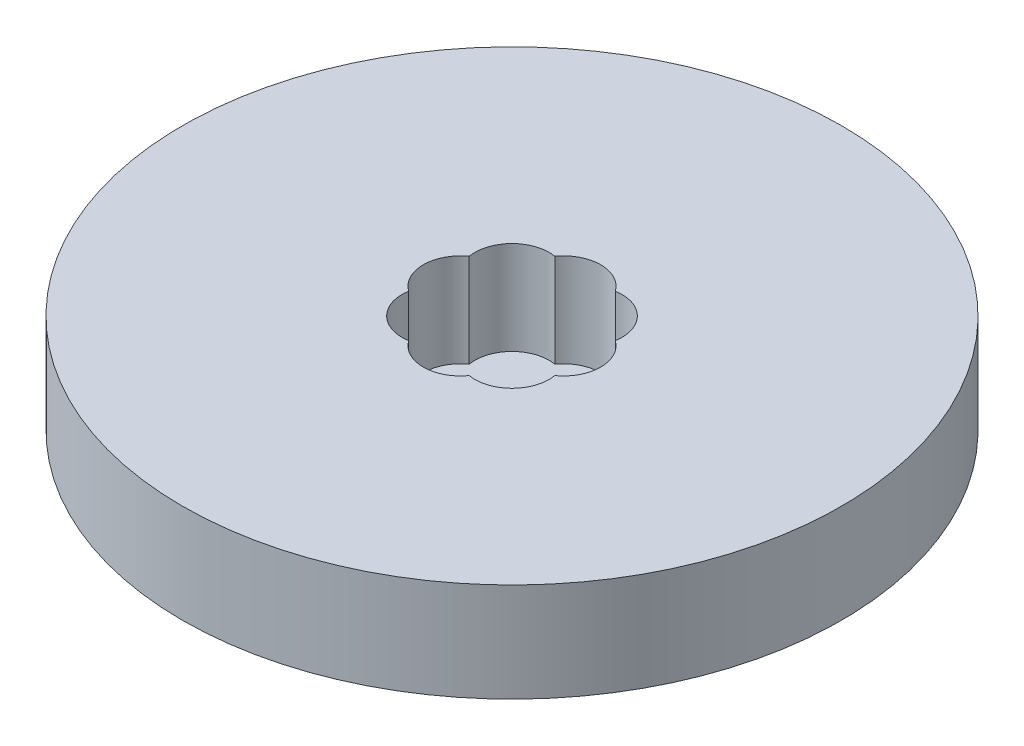
ISO-10303-21;
HEADER;
FILE_DESCRIPTION(('STEP AP214'),'2;1');
FILE_NAME('part.step','',(''),(''),'','','');
FILE_SCHEMA(('AUTOMOTIVE_DESIGN { 1 0 10303 214 1 1 1 1 }'));
ENDSEC;
DATA;
#1=APPLICATION_CONTEXT('core data for automotive mechanical design processes');
#2=APPLICATION_PROTOCOL_DEFINITION('international standard','automotive_design',2000,#1);
#3=PRODUCT_CONTEXT('',#1,'mechanical');
#4=PRODUCT('Part','Part','',(#3));
#5=PRODUCT_RELATED_PRODUCT_CATEGORY('part','',(#4));
#6=PRODUCT_DEFINITION_FORMATION('','',#4);
#7=PRODUCT_DEFINITION_CONTEXT('part definition',#1,'design');
#8=PRODUCT_DEFINITION('design','',#6,#7);
#9=PRODUCT_DEFINITION_SHAPE('','',#8);
#10=(LENGTH_UNIT() NAMED_UNIT(*) SI_UNIT(.MILLI.,.METRE.));
#11=(NAMED_UNIT(*) PLANE_ANGLE_UNIT() SI_UNIT($,.RADIAN.));
#12=(NAMED_UNIT(*) SI_UNIT($,.STERADIAN.) SOLID_ANGLE_UNIT());
#13=UNCERTAINTY_MEASURE_WITH_UNIT(LENGTH_MEASURE(1.E-05),#10,'distance_accuracy_value','');
#14=(GEOMETRIC_REPRESENTATION_CONTEXT(3) GLOBAL_UNCERTAINTY_ASSIGNED_CONTEXT((#13)) GLOBAL_UNIT_ASSIGNED_CONTEXT((#10,
#11,#12)) REPRESENTATION_CONTEXT('',''));
#15=CARTESIAN_POINT('',(0.,0.,0.));
#16=DIRECTION('',(0.,0.,1.));
#17=DIRECTION('',(1.,0.,0.));
#18=AXIS2_PLACEMENT_3D('',#15,#16,#17);
#19=CARTESIAN_POINT('',(0.,24.,0.));
#20=DIRECTION('',(0.,-1.,0.));
#21=DIRECTION('',(0.,0.,-1.));
#22=AXIS2_PLACEMENT_3D('',#19,#20,#21);
#23=CYLINDRICAL_SURFACE('',#22,7.5);
#24=CARTESIAN_POINT('',(0.,0.,0.));
#25=DIRECTION('',(0.,1.,0.));
#26=DIRECTION('',(0.,0.,1.));
#27=AXIS2_PLACEMENT_3D('',#24,#25,#26);
#28=CIRCLE('',#27,7.5);
#29=CARTESIAN_POINT('',(0.,0.,7.5));
#30=VERTEX_POINT('',#29);
#31=EDGE_CURVE('E169',#30,#30,#28,.T.);
#32=ORIENTED_EDGE('',*,*,#31,.F.);
#33=EDGE_LOOP('',(#32));
#34=FACE_BOUND('',#33,.T.);
#35=CARTESIAN_POINT('',(0.,1.30824147979161,0.));
#36=DIRECTION('',(0.,1.,0.));
#37=DIRECTION('',(0.,0.,1.));
#38=AXIS2_PLACEMENT_3D('',#35,#36,#37);
#39=CIRCLE('',#38,7.5);
#40=CARTESIAN_POINT('',(0.,1.30824147979161,7.5));
#41=VERTEX_POINT('',#40);
#42=EDGE_CURVE('E11',#41,#41,#39,.T.);
#43=ORIENTED_EDGE('',*,*,#42,.T.);
#44=EDGE_LOOP('',(#43));
#45=FACE_BOUND('',#44,.T.);
#46=ADVANCED_FACE('F39',(#34,#45),#23,.F.);
#47=CARTESIAN_POINT('',(0.,24.,0.));
#48=DIRECTION('',(0.,-1.,0.));
#49=DIRECTION('',(0.,0.,-1.));
#50=AXIS2_PLACEMENT_3D('',#47,#48,#49);
#51=CYLINDRICAL_SURFACE('',#50,80.);
#52=CARTESIAN_POINT('',(0.,24.,0.));
#53=DIRECTION('',(0.,1.,0.));
#54=DIRECTION('',(0.,0.,1.));
#55=AXIS2_PLACEMENT_3D('',#52,#53,#54);
#56=CIRCLE('',#55,80.);
#57=CARTESIAN_POINT('',(0.,24.,80.));
#58=VERTEX_POINT('',#57);
#59=EDGE_CURVE('E50',#58,#58,#56,.T.);
#60=ORIENTED_EDGE('',*,*,#59,.F.);
#61=EDGE_LOOP('',(#60));
#62=FACE_BOUND('',#61,.T.);
#63=CARTESIAN_POINT('',(0.,0.,0.));
#64=DIRECTION('',(0.,1.,0.));
#65=DIRECTION('',(0.,0.,1.));
#66=AXIS2_PLACEMENT_3D('',#63,#64,#65);
#67=CIRCLE('',#66,80.);
#68=CARTESIAN_POINT('',(0.,0.,80.));
#69=VERTEX_POINT('',#68);
#70=EDGE_CURVE('E172',#69,#69,#67,.T.);
#71=ORIENTED_EDGE('',*,*,#70,.T.);
#72=EDGE_LOOP('',(#71));
#73=FACE_BOUND('',#72,.T.);
#74=ADVANCED_FACE('F41',(#62,#73),#51,.T.);
#75=CARTESIAN_POINT('',(0.,24.,0.));
#76=DIRECTION('',(0.,1.,0.));
#77=DIRECTION('',(0.,0.,1.));
#78=AXIS2_PLACEMENT_3D('',#75,#76,#77);
#79=PLANE('',#78);
#80=CARTESIAN_POINT('',(-8.83814445048227,24.,-8.83814445048206));
#81=DIRECTION('',(0.,1.,0.));
#82=DIRECTION('',(-0.707106781186539,0.,0.707106781186556));
#83=AXIS2_PLACEMENT_3D('',#80,#81,#82);
#84=CIRCLE('',#83,9.02710982916651);
#85=CARTESIAN_POINT('',(-7.34878829511271,24.,-17.7415443690692));
#86=VERTEX_POINT('',#85);
#87=CARTESIAN_POINT('',(-17.7415443690694,24.,-7.34878829511244));
#88=VERTEX_POINT('',#87);
#89=EDGE_CURVE('E53',#86,#88,#84,.T.);
#90=ORIENTED_EDGE('',*,*,#89,.F.);
#91=CARTESIAN_POINT('',(-1.30920324510581E-13,24.,-12.4990237480844));
#92=DIRECTION('',(0.,1.,0.));
#93=DIRECTION('',(-1.,0.,0.));
#94=AXIS2_PLACEMENT_3D('',#91,#92,#93);
#95=CIRCLE('',#94,9.02710982916651);
#96=CARTESIAN_POINT('',(7.34878829511234,24.,-17.7415443690693));
#97=VERTEX_POINT('',#96);
#98=EDGE_CURVE('E117',#97,#86,#95,.T.);
#99=ORIENTED_EDGE('',*,*,#98,.F.);
#100=CARTESIAN_POINT('',(8.83814445048209,24.,-8.83814445048224));
#101=DIRECTION('',(0.,1.,0.));
#102=DIRECTION('',(-0.707106781186554,0.,-0.707106781186541));
#103=AXIS2_PLACEMENT_3D('',#100,#101,#102);
#104=CIRCLE('',#103,9.02710982916651);
#105=CARTESIAN_POINT('',(17.7415443690692,24.,-7.34878829511257));
#106=VERTEX_POINT('',#105);
#107=EDGE_CURVE('E120',#106,#97,#104,.T.);
#108=ORIENTED_EDGE('',*,*,#107,.F.);
#109=CARTESIAN_POINT('',(12.4990237480844,24.,0.));
#110=DIRECTION('',(0.,1.,0.));
#111=DIRECTION('',(0.,0.,-1.));
#112=AXIS2_PLACEMENT_3D('',#109,#110,#111);
#113=CIRCLE('',#112,9.02710982916651);
#114=CARTESIAN_POINT('',(17.7415443690693,24.,7.34878829511248));
#115=VERTEX_POINT('',#114);
#116=EDGE_CURVE('E136',#115,#106,#113,.T.);
#117=ORIENTED_EDGE('',*,*,#116,.F.);
#118=CARTESIAN_POINT('',(8.83814445048221,24.,8.83814445048212));
#119=DIRECTION('',(0.,1.,0.));
#120=DIRECTION('',(0.707106781186544,0.,-0.707106781186551));
#121=AXIS2_PLACEMENT_3D('',#118,#119,#120);
#122=CIRCLE('',#121,9.02710982916651);
#123=CARTESIAN_POINT('',(7.34878829511259,24.,17.7415443690692));
#124=VERTEX_POINT('',#123);
#125=EDGE_CURVE('E138',#124,#115,#122,.T.);
#126=ORIENTED_EDGE('',*,*,#125,.F.);
#127=CARTESIAN_POINT('',(0.,24.,12.4990237480844));
#128=DIRECTION('',(0.,1.,0.));
#129=DIRECTION('',(1.,0.,0.));
#130=AXIS2_PLACEMENT_3D('',#127,#128,#129);
#131=CIRCLE('',#130,9.02710982916651);
#132=CARTESIAN_POINT('',(-7.34878829511246,24.,17.7415443690693));
#133=VERTEX_POINT('',#132);
#134=EDGE_CURVE('E146',#133,#124,#131,.T.);
#135=ORIENTED_EDGE('',*,*,#134,.F.);
#136=CARTESIAN_POINT('',(-8.83814445048215,24.,8.83814445048218));
#137=DIRECTION('',(0.,1.,0.));
#138=DIRECTION('',(0.707106781186549,0.,0.707106781186546));
#139=AXIS2_PLACEMENT_3D('',#136,#137,#138);
#140=CIRCLE('',#139,9.02710982916651);
#141=CARTESIAN_POINT('',(-17.7415443690693,24.,7.34878829511252));
#142=VERTEX_POINT('',#141);
#143=EDGE_CURVE('E157',#142,#133,#140,.T.);
#144=ORIENTED_EDGE('',*,*,#143,.F.);
#145=CARTESIAN_POINT('',(-12.4990237480844,24.,0.));
#146=DIRECTION('',(0.,1.,0.));
#147=DIRECTION('',(0.,0.,1.));
#148=AXIS2_PLACEMENT_3D('',#145,#146,#147);
#149=CIRCLE('',#148,9.02710982916651);
#150=EDGE_CURVE('E164',#88,#142,#149,.T.);
#151=ORIENTED_EDGE('',*,*,#150,.F.);
#152=EDGE_LOOP('',(#90,#99,#108,#117,#126,#135,#144,#151));
#153=FACE_BOUND('',#152,.T.);
#154=ORIENTED_EDGE('',*,*,#59,.T.);
#155=EDGE_LOOP('',(#154));
#156=FACE_BOUND('',#155,.T.);
#157=ADVANCED_FACE('F185',(#153,#156),#79,.T.);
#158=CARTESIAN_POINT('',(0.,0.,0.));
#159=DIRECTION('',(0.,1.,0.));
#160=DIRECTION('',(0.,0.,1.));
#161=AXIS2_PLACEMENT_3D('',#158,#159,#160);
#162=PLANE('',#161);
#163=ORIENTED_EDGE('',*,*,#31,.T.);
#164=EDGE_LOOP('',(#163));
#165=FACE_BOUND('',#164,.T.);
#166=ORIENTED_EDGE('',*,*,#70,.F.);
#167=EDGE_LOOP('',(#166));
#168=FACE_BOUND('',#167,.T.);
#169=ADVANCED_FACE('F178',(#165,#168),#162,.F.);
#170=CARTESIAN_POINT('',(-12.4990237480844,1.30824147979161,0.));
#171=DIRECTION('',(0.,1.,0.));
#172=DIRECTION('',(0.,0.,1.));
#173=AXIS2_PLACEMENT_3D('',#170,#171,#172);
#174=CYLINDRICAL_SURFACE('',#173,9.02710982916651);
#175=ORIENTED_EDGE('',*,*,#150,.T.);
#176=DIRECTION('',(0.,1.,0.));
#177=VECTOR('',#176,1.);
#178=CARTESIAN_POINT('',(-17.7415443690693,12.6541207398958,7.34878829511252));
#179=LINE('',#178,#177);
#180=CARTESIAN_POINT('',(-17.7415443690693,1.30824147979161,7.34878829511252));
#181=VERTEX_POINT('',#180);
#182=EDGE_CURVE('E162',#142,#181,#179,.F.);
#183=ORIENTED_EDGE('',*,*,#182,.T.);
#184=CARTESIAN_POINT('',(-12.4990237480844,1.30824147979161,0.));
#185=DIRECTION('',(0.,1.,0.));
#186=DIRECTION('',(0.,0.,1.));
#187=AXIS2_PLACEMENT_3D('',#184,#185,#186);
#188=CIRCLE('',#187,9.02710982916651);
#189=CARTESIAN_POINT('',(-17.7415443690694,1.30824147979161,-7.34878829511243));
#190=VERTEX_POINT('',#189);
#191=EDGE_CURVE('E167',#190,#181,#188,.T.);
#192=ORIENTED_EDGE('',*,*,#191,.F.);
#193=DIRECTION('',(0.,1.,0.));
#194=VECTOR('',#193,1.);
#195=CARTESIAN_POINT('',(-17.7415443690694,12.6541207398958,-7.34878829511243));
#196=LINE('',#195,#194);
#197=EDGE_CURVE('E124',#190,#88,#196,.T.);
#198=ORIENTED_EDGE('',*,*,#197,.T.);
#199=EDGE_LOOP('',(#175,#183,#192,#198));
#200=FACE_BOUND('',#199,.T.);
#201=ADVANCED_FACE('F182',(#200),#174,.F.);
#202=CARTESIAN_POINT('',(-12.4990237480844,1.30824147979161,0.));
#203=DIRECTION('',(0.,1.,0.));
#204=DIRECTION('',(0.,0.,1.));
#205=AXIS2_PLACEMENT_3D('',#202,#203,#204);
#206=PLANE('',#205);
#207=ORIENTED_EDGE('',*,*,#191,.T.);
#208=CARTESIAN_POINT('',(-8.83814445048215,1.30824147979161,8.83814445048218));
#209=DIRECTION('',(0.,1.,0.));
#210=DIRECTION('',(0.707106781186549,0.,0.707106781186546));
#211=AXIS2_PLACEMENT_3D('',#208,#209,#210);
#212=CIRCLE('',#211,9.02710982916651);
#213=CARTESIAN_POINT('',(-7.34878829511246,1.30824147979161,17.7415443690693));
#214=VERTEX_POINT('',#213);
#215=EDGE_CURVE('E65',#181,#214,#212,.T.);
#216=ORIENTED_EDGE('',*,*,#215,.T.);
#217=CARTESIAN_POINT('',(0.,1.30824147979161,12.4990237480844));
#218=DIRECTION('',(0.,1.,0.));
#219=DIRECTION('',(1.,0.,0.));
#220=AXIS2_PLACEMENT_3D('',#217,#218,#219);
#221=CIRCLE('',#220,9.02710982916651);
#222=CARTESIAN_POINT('',(7.34878829511259,1.30824147979161,17.7415443690692));
#223=VERTEX_POINT('',#222);
#224=EDGE_CURVE('E149',#214,#223,#221,.T.);
#225=ORIENTED_EDGE('',*,*,#224,.T.);
#226=CARTESIAN_POINT('',(8.83814445048221,1.30824147979161,8.83814445048212));
#227=DIRECTION('',(0.,1.,0.));
#228=DIRECTION('',(0.707106781186544,0.,-0.707106781186551));
#229=AXIS2_PLACEMENT_3D('',#226,#227,#228);
#230=CIRCLE('',#229,9.02710982916651);
#231=CARTESIAN_POINT('',(17.7415443690693,1.30824147979161,7.34878829511248));
#232=VERTEX_POINT('',#231);
#233=EDGE_CURVE('E143',#223,#232,#230,.T.);
#234=ORIENTED_EDGE('',*,*,#233,.T.);
#235=CARTESIAN_POINT('',(12.4990237480844,1.30824147979161,0.));
#236=DIRECTION('',(0.,1.,0.));
#237=DIRECTION('',(0.,0.,-1.));
#238=AXIS2_PLACEMENT_3D('',#235,#236,#237);
#239=CIRCLE('',#238,9.02710982916651);
#240=CARTESIAN_POINT('',(17.7415443690692,1.30824147979161,-7.34878829511257));
#241=VERTEX_POINT('',#240);
#242=EDGE_CURVE('E140',#232,#241,#239,.T.);
#243=ORIENTED_EDGE('',*,*,#242,.T.);
#244=CARTESIAN_POINT('',(8.83814445048209,1.30824147979161,-8.83814445048224));
#245=DIRECTION('',(0.,1.,0.));
#246=DIRECTION('',(-0.707106781186554,0.,-0.707106781186541));
#247=AXIS2_PLACEMENT_3D('',#244,#245,#246);
#248=CIRCLE('',#247,9.02710982916651);
#249=CARTESIAN_POINT('',(7.34878829511234,1.30824147979161,-17.7415443690693));
#250=VERTEX_POINT('',#249);
#251=EDGE_CURVE('E111',#241,#250,#248,.T.);
#252=ORIENTED_EDGE('',*,*,#251,.T.);
#253=CARTESIAN_POINT('',(-1.30920324510581E-13,1.30824147979161,-12.4990237480844));
#254=DIRECTION('',(0.,1.,0.));
#255=DIRECTION('',(-1.,0.,0.));
#256=AXIS2_PLACEMENT_3D('',#253,#254,#255);
#257=CIRCLE('',#256,9.02710982916651);
#258=CARTESIAN_POINT('',(-7.34878829511271,1.30824147979161,-17.7415443690692));
#259=VERTEX_POINT('',#258);
#260=EDGE_CURVE('E104',#250,#259,#257,.T.);
#261=ORIENTED_EDGE('',*,*,#260,.T.);
#262=CARTESIAN_POINT('',(-8.83814445048227,1.30824147979161,-8.83814445048206));
#263=DIRECTION('',(0.,1.,0.));
#264=DIRECTION('',(-0.707106781186539,0.,0.707106781186556));
#265=AXIS2_PLACEMENT_3D('',#262,#263,#264);
#266=CIRCLE('',#265,9.02710982916651);
#267=EDGE_CURVE('E112',#259,#190,#266,.T.);
#268=ORIENTED_EDGE('',*,*,#267,.T.);
#269=EDGE_LOOP('',(#207,#216,#225,#234,#243,#252,#261,#268));
#270=FACE_BOUND('',#269,.T.);
#271=ORIENTED_EDGE('',*,*,#42,.F.);
#272=EDGE_LOOP('',(#271));
#273=FACE_BOUND('',#272,.T.);
#274=ADVANCED_FACE('F107',(#270,#273),#206,.T.);
#275=CARTESIAN_POINT('',(-8.83814445048215,1.30824147979161,8.83814445048218));
#276=DIRECTION('',(0.,1.,0.));
#277=DIRECTION('',(0.,0.,1.));
#278=AXIS2_PLACEMENT_3D('',#275,#276,#277);
#279=CYLINDRICAL_SURFACE('',#278,9.02710982916651);
#280=ORIENTED_EDGE('',*,*,#143,.T.);
#281=DIRECTION('',(0.,1.,0.));
#282=VECTOR('',#281,1.);
#283=CARTESIAN_POINT('',(-7.34878829511246,12.6541207398958,17.7415443690693));
#284=LINE('',#283,#282);
#285=EDGE_CURVE('E160',#133,#214,#284,.F.);
#286=ORIENTED_EDGE('',*,*,#285,.T.);
#287=ORIENTED_EDGE('',*,*,#215,.F.);
#288=ORIENTED_EDGE('',*,*,#182,.F.);
#289=EDGE_LOOP('',(#280,#286,#287,#288));
#290=FACE_BOUND('',#289,.T.);
#291=ADVANCED_FACE('F204',(#290),#279,.F.);
#292=CARTESIAN_POINT('',(-8.83814445048227,1.30824147979161,-8.83814445048206));
#293=DIRECTION('',(0.,1.,0.));
#294=DIRECTION('',(0.,0.,1.));
#295=AXIS2_PLACEMENT_3D('',#292,#293,#294);
#296=CYLINDRICAL_SURFACE('',#295,9.02710982916651);
#297=ORIENTED_EDGE('',*,*,#267,.F.);
#298=DIRECTION('',(0.,1.,0.));
#299=VECTOR('',#298,1.);
#300=CARTESIAN_POINT('',(-7.34878829511271,12.6541207398958,-17.7415443690692));
#301=LINE('',#300,#299);
#302=EDGE_CURVE('E119',#86,#259,#301,.F.);
#303=ORIENTED_EDGE('',*,*,#302,.F.);
#304=ORIENTED_EDGE('',*,*,#89,.T.);
#305=ORIENTED_EDGE('',*,*,#197,.F.);
#306=EDGE_LOOP('',(#297,#303,#304,#305));
#307=FACE_BOUND('',#306,.T.);
#308=ADVANCED_FACE('F123',(#307),#296,.F.);
#309=CARTESIAN_POINT('',(0.,1.30824147979161,12.4990237480844));
#310=DIRECTION('',(0.,1.,0.));
#311=DIRECTION('',(0.,0.,1.));
#312=AXIS2_PLACEMENT_3D('',#309,#310,#311);
#313=CYLINDRICAL_SURFACE('',#312,9.02710982916651);
#314=ORIENTED_EDGE('',*,*,#134,.T.);
#315=DIRECTION('',(0.,1.,0.));
#316=VECTOR('',#315,1.);
#317=CARTESIAN_POINT('',(7.34878829511259,12.6541207398958,17.7415443690692));
#318=LINE('',#317,#316);
#319=EDGE_CURVE('E141',#124,#223,#318,.F.);
#320=ORIENTED_EDGE('',*,*,#319,.T.);
#321=ORIENTED_EDGE('',*,*,#224,.F.);
#322=ORIENTED_EDGE('',*,*,#285,.F.);
#323=EDGE_LOOP('',(#314,#320,#321,#322));
#324=FACE_BOUND('',#323,.T.);
#325=ADVANCED_FACE('F210',(#324),#313,.F.);
#326=CARTESIAN_POINT('',(8.83814445048221,1.30824147979161,8.83814445048212));
#327=DIRECTION('',(0.,1.,0.));
#328=DIRECTION('',(0.,0.,1.));
#329=AXIS2_PLACEMENT_3D('',#326,#327,#328);
#330=CYLINDRICAL_SURFACE('',#329,9.02710982916651);
#331=DIRECTION('',(0.,1.,0.));
#332=VECTOR('',#331,1.);
#333=CARTESIAN_POINT('',(17.7415443690693,12.6541207398958,7.34878829511248));
#334=LINE('',#333,#332);
#335=EDGE_CURVE('E151',#115,#232,#334,.F.);
#336=ORIENTED_EDGE('',*,*,#335,.T.);
#337=ORIENTED_EDGE('',*,*,#233,.F.);
#338=ORIENTED_EDGE('',*,*,#319,.F.);
#339=ORIENTED_EDGE('',*,*,#125,.T.);
#340=EDGE_LOOP('',(#336,#337,#338,#339));
#341=FACE_BOUND('',#340,.T.);
#342=ADVANCED_FACE('F209',(#341),#330,.F.);
#343=CARTESIAN_POINT('',(12.4990237480844,1.30824147979161,0.));
#344=DIRECTION('',(0.,1.,0.));
#345=DIRECTION('',(0.,0.,1.));
#346=AXIS2_PLACEMENT_3D('',#343,#344,#345);
#347=CYLINDRICAL_SURFACE('',#346,9.02710982916651);
#348=ORIENTED_EDGE('',*,*,#116,.T.);
#349=DIRECTION('',(0.,1.,0.));
#350=VECTOR('',#349,1.);
#351=CARTESIAN_POINT('',(17.7415443690692,12.6541207398958,-7.34878829511257));
#352=LINE('',#351,#350);
#353=EDGE_CURVE('E131',#106,#241,#352,.F.);
#354=ORIENTED_EDGE('',*,*,#353,.T.);
#355=ORIENTED_EDGE('',*,*,#242,.F.);
#356=ORIENTED_EDGE('',*,*,#335,.F.);
#357=EDGE_LOOP('',(#348,#354,#355,#356));
#358=FACE_BOUND('',#357,.T.);
#359=ADVANCED_FACE('F212',(#358),#347,.F.);
#360=CARTESIAN_POINT('',(8.83814445048209,1.30824147979161,-8.83814445048224));
#361=DIRECTION('',(0.,1.,0.));
#362=DIRECTION('',(0.,0.,1.));
#363=AXIS2_PLACEMENT_3D('',#360,#361,#362);
#364=CYLINDRICAL_SURFACE('',#363,9.02710982916651);
#365=DIRECTION('',(0.,1.,0.));
#366=VECTOR('',#365,1.);
#367=CARTESIAN_POINT('',(7.34878829511234,12.6541207398958,-17.7415443690693));
#368=LINE('',#367,#366);
#369=EDGE_CURVE('E154',#97,#250,#368,.F.);
#370=ORIENTED_EDGE('',*,*,#369,.T.);
#371=ORIENTED_EDGE('',*,*,#251,.F.);
#372=ORIENTED_EDGE('',*,*,#353,.F.);
#373=ORIENTED_EDGE('',*,*,#107,.T.);
#374=EDGE_LOOP('',(#370,#371,#372,#373));
#375=FACE_BOUND('',#374,.T.);
#376=ADVANCED_FACE('F217',(#375),#364,.F.);
#377=CARTESIAN_POINT('',(-1.30920324510581E-13,1.30824147979161,-12.4990237480844));
#378=DIRECTION('',(0.,1.,0.));
#379=DIRECTION('',(0.,0.,1.));
#380=AXIS2_PLACEMENT_3D('',#377,#378,#379);
#381=CYLINDRICAL_SURFACE('',#380,9.02710982916651);
#382=ORIENTED_EDGE('',*,*,#98,.T.);
#383=ORIENTED_EDGE('',*,*,#302,.T.);
#384=ORIENTED_EDGE('',*,*,#260,.F.);
#385=ORIENTED_EDGE('',*,*,#369,.F.);
#386=EDGE_LOOP('',(#382,#383,#384,#385));
#387=FACE_BOUND('',#386,.T.);
#388=ADVANCED_FACE('F121',(#387),#381,.F.);
#389=CLOSED_SHELL('',(#46,#74,#157,#169,#201,#274,#291,#308,#325,#342,#359,#376,#388));
#390=MANIFOLD_SOLID_BREP('B2',#389);
#391=ADVANCED_BREP_SHAPE_REPRESENTATION('',(#18,#390),#14);
#392=SHAPE_DEFINITION_REPRESENTATION(#9,#391);
ENDSEC;
END-ISO-10303-21;
